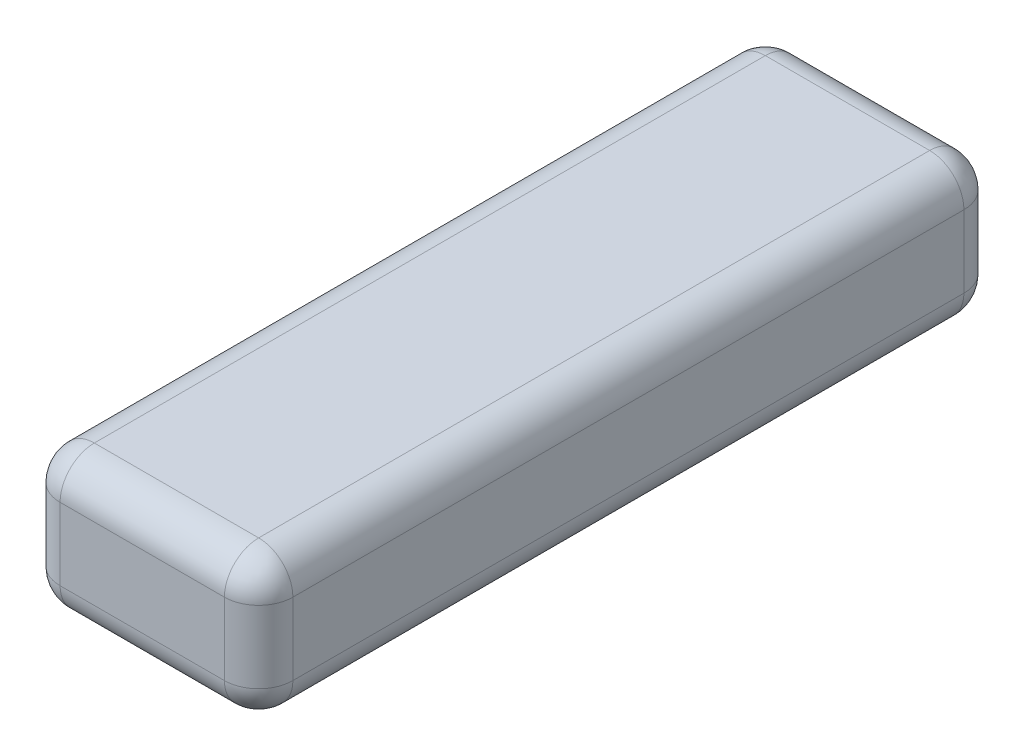
ISO-10303-21;
HEADER;
FILE_DESCRIPTION(('STEP AP214'),'2;1');
FILE_NAME('part.step','',(''),(''),'','','');
FILE_SCHEMA(('AUTOMOTIVE_DESIGN { 1 0 10303 214 1 1 1 1 }'));
ENDSEC;
DATA;
#1=APPLICATION_CONTEXT('core data for automotive mechanical design processes');
#2=APPLICATION_PROTOCOL_DEFINITION('international standard','automotive_design',2000,#1);
#3=PRODUCT_CONTEXT('',#1,'mechanical');
#4=PRODUCT('Part','Part','',(#3));
#5=PRODUCT_RELATED_PRODUCT_CATEGORY('part','',(#4));
#6=PRODUCT_DEFINITION_FORMATION('','',#4);
#7=PRODUCT_DEFINITION_CONTEXT('part definition',#1,'design');
#8=PRODUCT_DEFINITION('design','',#6,#7);
#9=PRODUCT_DEFINITION_SHAPE('','',#8);
#10=(LENGTH_UNIT() NAMED_UNIT(*) SI_UNIT(.MILLI.,.METRE.));
#11=(NAMED_UNIT(*) PLANE_ANGLE_UNIT() SI_UNIT($,.RADIAN.));
#12=(NAMED_UNIT(*) SI_UNIT($,.STERADIAN.) SOLID_ANGLE_UNIT());
#13=UNCERTAINTY_MEASURE_WITH_UNIT(LENGTH_MEASURE(1.E-05),#10,'distance_accuracy_value','');
#14=(GEOMETRIC_REPRESENTATION_CONTEXT(3) GLOBAL_UNCERTAINTY_ASSIGNED_CONTEXT((#13)) GLOBAL_UNIT_ASSIGNED_CONTEXT((#10,
#11,#12)) REPRESENTATION_CONTEXT('',''));
#15=CARTESIAN_POINT('',(0.,0.,0.));
#16=DIRECTION('',(0.,0.,1.));
#17=DIRECTION('',(1.,0.,0.));
#18=AXIS2_PLACEMENT_3D('',#15,#16,#17);
#19=CARTESIAN_POINT('',(17.,-10.05,54.));
#20=DIRECTION('',(1.,0.,0.));
#21=DIRECTION('',(0.,0.,-1.));
#22=AXIS2_PLACEMENT_3D('',#19,#20,#21);
#23=PLANE('',#22);
#24=DIRECTION('',(0.,1.,0.));
#25=VECTOR('',#24,1.);
#26=CARTESIAN_POINT('',(17.,-10.05,49.));
#27=LINE('',#26,#25);
#28=CARTESIAN_POINT('',(17.,5.5,49.));
#29=VERTEX_POINT('',#28);
#30=CARTESIAN_POINT('',(17.,-5.05,49.));
#31=VERTEX_POINT('',#30);
#32=EDGE_CURVE('E157',#29,#31,#27,.F.);
#33=ORIENTED_EDGE('',*,*,#32,.T.);
#34=DIRECTION('',(0.,0.,-1.));
#35=VECTOR('',#34,1.);
#36=CARTESIAN_POINT('',(17.,-5.05,54.));
#37=LINE('',#36,#35);
#38=CARTESIAN_POINT('',(17.,-5.05,-49.));
#39=VERTEX_POINT('',#38);
#40=EDGE_CURVE('E133',#31,#39,#37,.T.);
#41=ORIENTED_EDGE('',*,*,#40,.T.);
#42=DIRECTION('',(0.,1.,0.));
#43=VECTOR('',#42,1.);
#44=CARTESIAN_POINT('',(17.,-10.05,-49.));
#45=LINE('',#44,#43);
#46=CARTESIAN_POINT('',(17.,5.5,-49.));
#47=VERTEX_POINT('',#46);
#48=EDGE_CURVE('E154',#39,#47,#45,.T.);
#49=ORIENTED_EDGE('',*,*,#48,.T.);
#50=DIRECTION('',(0.,0.,-1.));
#51=VECTOR('',#50,1.);
#52=CARTESIAN_POINT('',(17.,5.5,49.));
#53=LINE('',#52,#51);
#54=EDGE_CURVE('E160',#47,#29,#53,.F.);
#55=ORIENTED_EDGE('',*,*,#54,.T.);
#56=EDGE_LOOP('',(#33,#41,#49,#55));
#57=FACE_BOUND('',#56,.T.);
#58=ADVANCED_FACE('F38',(#57),#23,.T.);
#59=CARTESIAN_POINT('',(-17.,-10.05,54.));
#60=DIRECTION('',(0.,0.,1.));
#61=DIRECTION('',(1.,0.,0.));
#62=AXIS2_PLACEMENT_3D('',#59,#60,#61);
#63=PLANE('',#62);
#64=DIRECTION('',(0.,1.,0.));
#65=VECTOR('',#64,1.);
#66=CARTESIAN_POINT('',(-12.,-10.05,54.));
#67=LINE('',#66,#65);
#68=CARTESIAN_POINT('',(-12.,5.5,54.));
#69=VERTEX_POINT('',#68);
#70=CARTESIAN_POINT('',(-12.,-5.05,54.));
#71=VERTEX_POINT('',#70);
#72=EDGE_CURVE('E182',#69,#71,#67,.F.);
#73=ORIENTED_EDGE('',*,*,#72,.T.);
#74=DIRECTION('',(1.,0.,0.));
#75=VECTOR('',#74,1.);
#76=CARTESIAN_POINT('',(-17.,-5.05,54.));
#77=LINE('',#76,#75);
#78=CARTESIAN_POINT('',(12.,-5.05,54.));
#79=VERTEX_POINT('',#78);
#80=EDGE_CURVE('E211',#71,#79,#77,.T.);
#81=ORIENTED_EDGE('',*,*,#80,.T.);
#82=DIRECTION('',(0.,1.,0.));
#83=VECTOR('',#82,1.);
#84=CARTESIAN_POINT('',(12.,-10.05,54.));
#85=LINE('',#84,#83);
#86=CARTESIAN_POINT('',(12.,5.5,54.));
#87=VERTEX_POINT('',#86);
#88=EDGE_CURVE('E179',#79,#87,#85,.T.);
#89=ORIENTED_EDGE('',*,*,#88,.T.);
#90=DIRECTION('',(1.,0.,0.));
#91=VECTOR('',#90,1.);
#92=CARTESIAN_POINT('',(-12.,5.5,54.));
#93=LINE('',#92,#91);
#94=EDGE_CURVE('E208',#87,#69,#93,.F.);
#95=ORIENTED_EDGE('',*,*,#94,.T.);
#96=EDGE_LOOP('',(#73,#81,#89,#95));
#97=FACE_BOUND('',#96,.T.);
#98=ADVANCED_FACE('F300',(#97),#63,.T.);
#99=CARTESIAN_POINT('',(-17.,-10.05,54.));
#100=DIRECTION('',(-1.,0.,0.));
#101=DIRECTION('',(0.,0.,1.));
#102=AXIS2_PLACEMENT_3D('',#99,#100,#101);
#103=PLANE('',#102);
#104=DIRECTION('',(0.,1.,0.));
#105=VECTOR('',#104,1.);
#106=CARTESIAN_POINT('',(-17.,-10.05,-49.));
#107=LINE('',#106,#105);
#108=CARTESIAN_POINT('',(-17.,5.5,-49.));
#109=VERTEX_POINT('',#108);
#110=CARTESIAN_POINT('',(-17.,-5.05,-49.));
#111=VERTEX_POINT('',#110);
#112=EDGE_CURVE('E176',#109,#111,#107,.F.);
#113=ORIENTED_EDGE('',*,*,#112,.T.);
#114=DIRECTION('',(0.,0.,1.));
#115=VECTOR('',#114,1.);
#116=CARTESIAN_POINT('',(-17.,-5.05,54.));
#117=LINE('',#116,#115);
#118=CARTESIAN_POINT('',(-17.,-5.05,49.));
#119=VERTEX_POINT('',#118);
#120=EDGE_CURVE('E202',#111,#119,#117,.T.);
#121=ORIENTED_EDGE('',*,*,#120,.T.);
#122=DIRECTION('',(0.,1.,0.));
#123=VECTOR('',#122,1.);
#124=CARTESIAN_POINT('',(-17.,-10.05,49.));
#125=LINE('',#124,#123);
#126=CARTESIAN_POINT('',(-17.,5.5,49.));
#127=VERTEX_POINT('',#126);
#128=EDGE_CURVE('E173',#119,#127,#125,.T.);
#129=ORIENTED_EDGE('',*,*,#128,.T.);
#130=DIRECTION('',(0.,0.,1.));
#131=VECTOR('',#130,1.);
#132=CARTESIAN_POINT('',(-17.,5.5,-49.));
#133=LINE('',#132,#131);
#134=EDGE_CURVE('E200',#127,#109,#133,.F.);
#135=ORIENTED_EDGE('',*,*,#134,.T.);
#136=EDGE_LOOP('',(#113,#121,#129,#135));
#137=FACE_BOUND('',#136,.T.);
#138=ADVANCED_FACE('F288',(#137),#103,.T.);
#139=CARTESIAN_POINT('',(-17.,-10.05,-54.));
#140=DIRECTION('',(0.,0.,-1.));
#141=DIRECTION('',(-1.,0.,0.));
#142=AXIS2_PLACEMENT_3D('',#139,#140,#141);
#143=PLANE('',#142);
#144=DIRECTION('',(0.,1.,0.));
#145=VECTOR('',#144,1.);
#146=CARTESIAN_POINT('',(12.,-10.05,-54.));
#147=LINE('',#146,#145);
#148=CARTESIAN_POINT('',(12.,5.5,-54.));
#149=VERTEX_POINT('',#148);
#150=CARTESIAN_POINT('',(12.,-5.05,-54.));
#151=VERTEX_POINT('',#150);
#152=EDGE_CURVE('E167',#149,#151,#147,.F.);
#153=ORIENTED_EDGE('',*,*,#152,.T.);
#154=DIRECTION('',(-1.,0.,0.));
#155=VECTOR('',#154,1.);
#156=CARTESIAN_POINT('',(-17.,-5.05,-54.));
#157=LINE('',#156,#155);
#158=CARTESIAN_POINT('',(-12.,-5.05,-54.));
#159=VERTEX_POINT('',#158);
#160=EDGE_CURVE('E194',#151,#159,#157,.T.);
#161=ORIENTED_EDGE('',*,*,#160,.T.);
#162=DIRECTION('',(0.,1.,0.));
#163=VECTOR('',#162,1.);
#164=CARTESIAN_POINT('',(-12.,-10.05,-54.));
#165=LINE('',#164,#163);
#166=CARTESIAN_POINT('',(-12.,5.5,-54.));
#167=VERTEX_POINT('',#166);
#168=EDGE_CURVE('E164',#159,#167,#165,.T.);
#169=ORIENTED_EDGE('',*,*,#168,.T.);
#170=DIRECTION('',(-1.,0.,0.));
#171=VECTOR('',#170,1.);
#172=CARTESIAN_POINT('',(12.,5.5,-54.));
#173=LINE('',#172,#171);
#174=EDGE_CURVE('E148',#167,#149,#173,.F.);
#175=ORIENTED_EDGE('',*,*,#174,.T.);
#176=EDGE_LOOP('',(#153,#161,#169,#175));
#177=FACE_BOUND('',#176,.T.);
#178=ADVANCED_FACE('F263',(#177),#143,.T.);
#179=CARTESIAN_POINT('',(0.,-10.05,0.));
#180=DIRECTION('',(0.,-1.,0.));
#181=DIRECTION('',(0.,0.,-1.));
#182=AXIS2_PLACEMENT_3D('',#179,#180,#181);
#183=PLANE('',#182);
#184=DIRECTION('',(-1.,0.,0.));
#185=VECTOR('',#184,1.);
#186=CARTESIAN_POINT('',(0.,-10.05,-49.));
#187=LINE('',#186,#185);
#188=CARTESIAN_POINT('',(-12.,-10.05,-49.));
#189=VERTEX_POINT('',#188);
#190=CARTESIAN_POINT('',(12.,-10.05,-49.));
#191=VERTEX_POINT('',#190);
#192=EDGE_CURVE('E189',#189,#191,#187,.F.);
#193=ORIENTED_EDGE('',*,*,#192,.T.);
#194=DIRECTION('',(0.,0.,-1.));
#195=VECTOR('',#194,1.);
#196=CARTESIAN_POINT('',(12.,-10.05,0.));
#197=LINE('',#196,#195);
#198=CARTESIAN_POINT('',(12.,-10.05,49.));
#199=VERTEX_POINT('',#198);
#200=EDGE_CURVE('E135',#191,#199,#197,.F.);
#201=ORIENTED_EDGE('',*,*,#200,.T.);
#202=DIRECTION('',(1.,0.,0.));
#203=VECTOR('',#202,1.);
#204=CARTESIAN_POINT('',(0.,-10.05,49.));
#205=LINE('',#204,#203);
#206=CARTESIAN_POINT('',(-12.,-10.05,49.));
#207=VERTEX_POINT('',#206);
#208=EDGE_CURVE('E159',#199,#207,#205,.F.);
#209=ORIENTED_EDGE('',*,*,#208,.T.);
#210=DIRECTION('',(0.,0.,1.));
#211=VECTOR('',#210,1.);
#212=CARTESIAN_POINT('',(-12.,-10.05,0.));
#213=LINE('',#212,#211);
#214=EDGE_CURVE('E187',#207,#189,#213,.F.);
#215=ORIENTED_EDGE('',*,*,#214,.T.);
#216=EDGE_LOOP('',(#193,#201,#209,#215));
#217=FACE_BOUND('',#216,.T.);
#218=ADVANCED_FACE('F278',(#217),#183,.T.);
#219=CARTESIAN_POINT('',(0.,10.5,0.));
#220=DIRECTION('',(0.,-1.,0.));
#221=DIRECTION('',(0.,0.,-1.));
#222=AXIS2_PLACEMENT_3D('',#219,#220,#221);
#223=PLANE('',#222);
#224=DIRECTION('',(0.,0.,1.));
#225=VECTOR('',#224,1.);
#226=CARTESIAN_POINT('',(-12.,10.5,49.));
#227=LINE('',#226,#225);
#228=CARTESIAN_POINT('',(-12.,10.5,-49.));
#229=VERTEX_POINT('',#228);
#230=CARTESIAN_POINT('',(-12.,10.5,49.));
#231=VERTEX_POINT('',#230);
#232=EDGE_CURVE('E55',#229,#231,#227,.T.);
#233=ORIENTED_EDGE('',*,*,#232,.T.);
#234=DIRECTION('',(1.,0.,0.));
#235=VECTOR('',#234,1.);
#236=CARTESIAN_POINT('',(12.,10.5,49.));
#237=LINE('',#236,#235);
#238=CARTESIAN_POINT('',(12.,10.5,49.));
#239=VERTEX_POINT('',#238);
#240=EDGE_CURVE('E217',#231,#239,#237,.T.);
#241=ORIENTED_EDGE('',*,*,#240,.T.);
#242=DIRECTION('',(0.,0.,-1.));
#243=VECTOR('',#242,1.);
#244=CARTESIAN_POINT('',(12.,10.5,-49.));
#245=LINE('',#244,#243);
#246=CARTESIAN_POINT('',(12.,10.5,-49.));
#247=VERTEX_POINT('',#246);
#248=EDGE_CURVE('E213',#239,#247,#245,.T.);
#249=ORIENTED_EDGE('',*,*,#248,.T.);
#250=DIRECTION('',(-1.,0.,0.));
#251=VECTOR('',#250,1.);
#252=CARTESIAN_POINT('',(-12.,10.5,-49.));
#253=LINE('',#252,#251);
#254=EDGE_CURVE('E60',#247,#229,#253,.T.);
#255=ORIENTED_EDGE('',*,*,#254,.T.);
#256=EDGE_LOOP('',(#233,#241,#249,#255));
#257=FACE_BOUND('',#256,.T.);
#258=ADVANCED_FACE('F314',(#257),#223,.F.);
#259=CARTESIAN_POINT('',(12.,-10.05,-49.));
#260=DIRECTION('',(0.,1.,0.));
#261=DIRECTION('',(0.,0.,1.));
#262=AXIS2_PLACEMENT_3D('',#259,#260,#261);
#263=CYLINDRICAL_SURFACE('',#262,5.);
#264=ORIENTED_EDGE('',*,*,#48,.F.);
#265=CARTESIAN_POINT('',(12.,-5.05,-49.));
#266=DIRECTION('',(0.,1.,0.));
#267=DIRECTION('',(0.,0.,1.));
#268=AXIS2_PLACEMENT_3D('',#265,#266,#267);
#269=CIRCLE('',#268,5.);
#270=EDGE_CURVE('E140',#39,#151,#269,.T.);
#271=ORIENTED_EDGE('',*,*,#270,.T.);
#272=ORIENTED_EDGE('',*,*,#152,.F.);
#273=CARTESIAN_POINT('',(12.,5.5,-49.));
#274=DIRECTION('',(0.,1.,0.));
#275=DIRECTION('',(0.,0.,1.));
#276=AXIS2_PLACEMENT_3D('',#273,#274,#275);
#277=CIRCLE('',#276,5.);
#278=EDGE_CURVE('E149',#149,#47,#277,.F.);
#279=ORIENTED_EDGE('',*,*,#278,.T.);
#280=EDGE_LOOP('',(#264,#271,#272,#279));
#281=FACE_BOUND('',#280,.T.);
#282=ADVANCED_FACE('F162',(#281),#263,.T.);
#283=CARTESIAN_POINT('',(-12.,-10.05,-49.));
#284=DIRECTION('',(0.,1.,0.));
#285=DIRECTION('',(0.,0.,1.));
#286=AXIS2_PLACEMENT_3D('',#283,#284,#285);
#287=CYLINDRICAL_SURFACE('',#286,5.);
#288=ORIENTED_EDGE('',*,*,#168,.F.);
#289=CARTESIAN_POINT('',(-12.,-5.05,-49.));
#290=DIRECTION('',(0.,1.,0.));
#291=DIRECTION('',(0.,0.,1.));
#292=AXIS2_PLACEMENT_3D('',#289,#290,#291);
#293=CIRCLE('',#292,5.);
#294=EDGE_CURVE('E198',#159,#111,#293,.T.);
#295=ORIENTED_EDGE('',*,*,#294,.T.);
#296=ORIENTED_EDGE('',*,*,#112,.F.);
#297=CARTESIAN_POINT('',(-12.,5.5,-49.));
#298=DIRECTION('',(0.,1.,0.));
#299=DIRECTION('',(0.,0.,1.));
#300=AXIS2_PLACEMENT_3D('',#297,#298,#299);
#301=CIRCLE('',#300,5.);
#302=EDGE_CURVE('E196',#109,#167,#301,.F.);
#303=ORIENTED_EDGE('',*,*,#302,.T.);
#304=EDGE_LOOP('',(#288,#295,#296,#303));
#305=FACE_BOUND('',#304,.T.);
#306=ADVANCED_FACE('F268',(#305),#287,.T.);
#307=CARTESIAN_POINT('',(-12.,-10.05,49.));
#308=DIRECTION('',(0.,1.,0.));
#309=DIRECTION('',(0.,0.,1.));
#310=AXIS2_PLACEMENT_3D('',#307,#308,#309);
#311=CYLINDRICAL_SURFACE('',#310,5.);
#312=ORIENTED_EDGE('',*,*,#128,.F.);
#313=CARTESIAN_POINT('',(-12.,-5.05,49.));
#314=DIRECTION('',(0.,1.,0.));
#315=DIRECTION('',(0.,0.,1.));
#316=AXIS2_PLACEMENT_3D('',#313,#314,#315);
#317=CIRCLE('',#316,5.);
#318=EDGE_CURVE('E206',#119,#71,#317,.T.);
#319=ORIENTED_EDGE('',*,*,#318,.T.);
#320=ORIENTED_EDGE('',*,*,#72,.F.);
#321=CARTESIAN_POINT('',(-12.,5.5,49.));
#322=DIRECTION('',(0.,1.,0.));
#323=DIRECTION('',(0.,0.,1.));
#324=AXIS2_PLACEMENT_3D('',#321,#322,#323);
#325=CIRCLE('',#324,5.);
#326=EDGE_CURVE('E204',#69,#127,#325,.F.);
#327=ORIENTED_EDGE('',*,*,#326,.T.);
#328=EDGE_LOOP('',(#312,#319,#320,#327));
#329=FACE_BOUND('',#328,.T.);
#330=ADVANCED_FACE('F291',(#329),#311,.T.);
#331=CARTESIAN_POINT('',(12.,-10.05,49.));
#332=DIRECTION('',(0.,1.,0.));
#333=DIRECTION('',(0.,0.,1.));
#334=AXIS2_PLACEMENT_3D('',#331,#332,#333);
#335=CYLINDRICAL_SURFACE('',#334,5.);
#336=ORIENTED_EDGE('',*,*,#88,.F.);
#337=CARTESIAN_POINT('',(12.,-5.05,49.));
#338=DIRECTION('',(0.,1.,0.));
#339=DIRECTION('',(0.,0.,1.));
#340=AXIS2_PLACEMENT_3D('',#337,#338,#339);
#341=CIRCLE('',#340,5.);
#342=EDGE_CURVE('E11',#79,#31,#341,.T.);
#343=ORIENTED_EDGE('',*,*,#342,.T.);
#344=ORIENTED_EDGE('',*,*,#32,.F.);
#345=CARTESIAN_POINT('',(12.,5.5,49.));
#346=DIRECTION('',(0.,1.,0.));
#347=DIRECTION('',(0.,0.,1.));
#348=AXIS2_PLACEMENT_3D('',#345,#346,#347);
#349=CIRCLE('',#348,5.);
#350=EDGE_CURVE('E47',#29,#87,#349,.F.);
#351=ORIENTED_EDGE('',*,*,#350,.T.);
#352=EDGE_LOOP('',(#336,#343,#344,#351));
#353=FACE_BOUND('',#352,.T.);
#354=ADVANCED_FACE('F336',(#353),#335,.T.);
#355=CARTESIAN_POINT('',(-12.,-5.05,54.));
#356=DIRECTION('',(0.,0.,1.));
#357=DIRECTION('',(1.,0.,0.));
#358=AXIS2_PLACEMENT_3D('',#355,#356,#357);
#359=CYLINDRICAL_SURFACE('',#358,5.);
#360=CARTESIAN_POINT('',(-12.,-5.05,49.));
#361=DIRECTION('',(0.,0.,1.));
#362=DIRECTION('',(1.,0.,0.));
#363=AXIS2_PLACEMENT_3D('',#360,#361,#362);
#364=CIRCLE('',#363,5.);
#365=EDGE_CURVE('E169',#119,#207,#364,.T.);
#366=ORIENTED_EDGE('',*,*,#365,.F.);
#367=ORIENTED_EDGE('',*,*,#120,.F.);
#368=CARTESIAN_POINT('',(-12.,-5.05,-49.));
#369=DIRECTION('',(0.,0.,-1.));
#370=DIRECTION('',(-1.,0.,0.));
#371=AXIS2_PLACEMENT_3D('',#368,#369,#370);
#372=CIRCLE('',#371,5.);
#373=EDGE_CURVE('E231',#189,#111,#372,.T.);
#374=ORIENTED_EDGE('',*,*,#373,.F.);
#375=ORIENTED_EDGE('',*,*,#214,.F.);
#376=EDGE_LOOP('',(#366,#367,#374,#375));
#377=FACE_BOUND('',#376,.T.);
#378=ADVANCED_FACE('F284',(#377),#359,.T.);
#379=CARTESIAN_POINT('',(-12.,-5.05,49.));
#380=DIRECTION('',(0.,-1.,0.));
#381=DIRECTION('',(0.,0.,-1.));
#382=AXIS2_PLACEMENT_3D('',#379,#380,#381);
#383=SPHERICAL_SURFACE('',#382,5.);
#384=ORIENTED_EDGE('',*,*,#318,.F.);
#385=ORIENTED_EDGE('',*,*,#365,.T.);
#386=CARTESIAN_POINT('',(-12.,-5.05,49.));
#387=DIRECTION('',(1.,0.,0.));
#388=DIRECTION('',(0.,0.,-1.));
#389=AXIS2_PLACEMENT_3D('',#386,#387,#388);
#390=CIRCLE('',#389,5.);
#391=EDGE_CURVE('E228',#71,#207,#390,.T.);
#392=ORIENTED_EDGE('',*,*,#391,.F.);
#393=EDGE_LOOP('',(#384,#385,#392));
#394=FACE_BOUND('',#393,.T.);
#395=ADVANCED_FACE('F356',(#394),#383,.T.);
#396=CARTESIAN_POINT('',(-12.,-5.05,-49.));
#397=DIRECTION('',(0.,-1.,0.));
#398=DIRECTION('',(0.,0.,-1.));
#399=AXIS2_PLACEMENT_3D('',#396,#397,#398);
#400=SPHERICAL_SURFACE('',#399,5.);
#401=ORIENTED_EDGE('',*,*,#373,.T.);
#402=ORIENTED_EDGE('',*,*,#294,.F.);
#403=CARTESIAN_POINT('',(-12.,-5.05,-49.));
#404=DIRECTION('',(1.,0.,0.));
#405=DIRECTION('',(0.,0.,-1.));
#406=AXIS2_PLACEMENT_3D('',#403,#404,#405);
#407=CIRCLE('',#406,5.);
#408=EDGE_CURVE('E225',#189,#159,#407,.T.);
#409=ORIENTED_EDGE('',*,*,#408,.F.);
#410=EDGE_LOOP('',(#401,#402,#409));
#411=FACE_BOUND('',#410,.T.);
#412=ADVANCED_FACE('F272',(#411),#400,.T.);
#413=CARTESIAN_POINT('',(-17.,-5.05,49.));
#414=DIRECTION('',(1.,0.,0.));
#415=DIRECTION('',(0.,0.,-1.));
#416=AXIS2_PLACEMENT_3D('',#413,#414,#415);
#417=CYLINDRICAL_SURFACE('',#416,5.);
#418=ORIENTED_EDGE('',*,*,#391,.T.);
#419=ORIENTED_EDGE('',*,*,#208,.F.);
#420=CARTESIAN_POINT('',(12.,-5.05,49.));
#421=DIRECTION('',(1.,0.,0.));
#422=DIRECTION('',(0.,0.,-1.));
#423=AXIS2_PLACEMENT_3D('',#420,#421,#422);
#424=CIRCLE('',#423,5.);
#425=EDGE_CURVE('E222',#79,#199,#424,.T.);
#426=ORIENTED_EDGE('',*,*,#425,.F.);
#427=ORIENTED_EDGE('',*,*,#80,.F.);
#428=EDGE_LOOP('',(#418,#419,#426,#427));
#429=FACE_BOUND('',#428,.T.);
#430=ADVANCED_FACE('F350',(#429),#417,.T.);
#431=CARTESIAN_POINT('',(-17.,-5.05,-49.));
#432=DIRECTION('',(-1.,0.,0.));
#433=DIRECTION('',(0.,0.,1.));
#434=AXIS2_PLACEMENT_3D('',#431,#432,#433);
#435=CYLINDRICAL_SURFACE('',#434,5.);
#436=ORIENTED_EDGE('',*,*,#408,.T.);
#437=ORIENTED_EDGE('',*,*,#160,.F.);
#438=CARTESIAN_POINT('',(12.,-5.05,-49.));
#439=DIRECTION('',(1.,0.,0.));
#440=DIRECTION('',(0.,0.,-1.));
#441=AXIS2_PLACEMENT_3D('',#438,#439,#440);
#442=CIRCLE('',#441,5.);
#443=EDGE_CURVE('E143',#191,#151,#442,.T.);
#444=ORIENTED_EDGE('',*,*,#443,.F.);
#445=ORIENTED_EDGE('',*,*,#192,.F.);
#446=EDGE_LOOP('',(#436,#437,#444,#445));
#447=FACE_BOUND('',#446,.T.);
#448=ADVANCED_FACE('F276',(#447),#435,.T.);
#449=CARTESIAN_POINT('',(12.,-5.05,49.));
#450=DIRECTION('',(0.,-1.,0.));
#451=DIRECTION('',(0.,0.,-1.));
#452=AXIS2_PLACEMENT_3D('',#449,#450,#451);
#453=SPHERICAL_SURFACE('',#452,5.);
#454=ORIENTED_EDGE('',*,*,#342,.F.);
#455=ORIENTED_EDGE('',*,*,#425,.T.);
#456=CARTESIAN_POINT('',(12.,-5.05,49.));
#457=DIRECTION('',(0.,0.,-1.));
#458=DIRECTION('',(-1.,0.,0.));
#459=AXIS2_PLACEMENT_3D('',#456,#457,#458);
#460=CIRCLE('',#459,5.);
#461=EDGE_CURVE('E138',#31,#199,#460,.T.);
#462=ORIENTED_EDGE('',*,*,#461,.F.);
#463=EDGE_LOOP('',(#454,#455,#462));
#464=FACE_BOUND('',#463,.T.);
#465=ADVANCED_FACE('F344',(#464),#453,.T.);
#466=CARTESIAN_POINT('',(12.,-5.05,-49.));
#467=DIRECTION('',(0.,-1.,0.));
#468=DIRECTION('',(0.,0.,-1.));
#469=AXIS2_PLACEMENT_3D('',#466,#467,#468);
#470=SPHERICAL_SURFACE('',#469,5.);
#471=ORIENTED_EDGE('',*,*,#443,.T.);
#472=ORIENTED_EDGE('',*,*,#270,.F.);
#473=CARTESIAN_POINT('',(12.,-5.05,-49.));
#474=DIRECTION('',(0.,0.,1.));
#475=DIRECTION('',(1.,0.,0.));
#476=AXIS2_PLACEMENT_3D('',#473,#474,#475);
#477=CIRCLE('',#476,5.);
#478=EDGE_CURVE('E129',#191,#39,#477,.T.);
#479=ORIENTED_EDGE('',*,*,#478,.F.);
#480=EDGE_LOOP('',(#471,#472,#479));
#481=FACE_BOUND('',#480,.T.);
#482=ADVANCED_FACE('F141',(#481),#470,.T.);
#483=CARTESIAN_POINT('',(12.,-5.05,54.));
#484=DIRECTION('',(0.,0.,-1.));
#485=DIRECTION('',(-1.,0.,0.));
#486=AXIS2_PLACEMENT_3D('',#483,#484,#485);
#487=CYLINDRICAL_SURFACE('',#486,5.);
#488=ORIENTED_EDGE('',*,*,#461,.T.);
#489=ORIENTED_EDGE('',*,*,#200,.F.);
#490=ORIENTED_EDGE('',*,*,#478,.T.);
#491=ORIENTED_EDGE('',*,*,#40,.F.);
#492=EDGE_LOOP('',(#488,#489,#490,#491));
#493=FACE_BOUND('',#492,.T.);
#494=ADVANCED_FACE('F131',(#493),#487,.T.);
#495=CARTESIAN_POINT('',(0.,5.5,-49.));
#496=DIRECTION('',(1.,0.,0.));
#497=DIRECTION('',(0.,0.,-1.));
#498=AXIS2_PLACEMENT_3D('',#495,#496,#497);
#499=CYLINDRICAL_SURFACE('',#498,5.);
#500=CARTESIAN_POINT('',(12.,5.5,-49.));
#501=DIRECTION('',(1.,0.,0.));
#502=DIRECTION('',(0.,0.,-1.));
#503=AXIS2_PLACEMENT_3D('',#500,#501,#502);
#504=CIRCLE('',#503,5.);
#505=EDGE_CURVE('E251',#149,#247,#504,.T.);
#506=ORIENTED_EDGE('',*,*,#505,.F.);
#507=ORIENTED_EDGE('',*,*,#174,.F.);
#508=CARTESIAN_POINT('',(-12.,5.5,-49.));
#509=DIRECTION('',(-1.,0.,0.));
#510=DIRECTION('',(0.,0.,1.));
#511=AXIS2_PLACEMENT_3D('',#508,#509,#510);
#512=CIRCLE('',#511,5.);
#513=EDGE_CURVE('E42',#229,#167,#512,.T.);
#514=ORIENTED_EDGE('',*,*,#513,.F.);
#515=ORIENTED_EDGE('',*,*,#254,.F.);
#516=EDGE_LOOP('',(#506,#507,#514,#515));
#517=FACE_BOUND('',#516,.T.);
#518=ADVANCED_FACE('F40',(#517),#499,.T.);
#519=CARTESIAN_POINT('',(-12.,5.5,-49.));
#520=DIRECTION('',(0.,-1.,0.));
#521=DIRECTION('',(0.,0.,-1.));
#522=AXIS2_PLACEMENT_3D('',#519,#520,#521);
#523=SPHERICAL_SURFACE('',#522,5.);
#524=ORIENTED_EDGE('',*,*,#513,.T.);
#525=ORIENTED_EDGE('',*,*,#302,.F.);
#526=CARTESIAN_POINT('',(-12.,5.5,-49.));
#527=DIRECTION('',(0.,0.,1.));
#528=DIRECTION('',(1.,0.,0.));
#529=AXIS2_PLACEMENT_3D('',#526,#527,#528);
#530=CIRCLE('',#529,5.);
#531=EDGE_CURVE('E249',#229,#109,#530,.T.);
#532=ORIENTED_EDGE('',*,*,#531,.F.);
#533=EDGE_LOOP('',(#524,#525,#532));
#534=FACE_BOUND('',#533,.T.);
#535=ADVANCED_FACE('F259',(#534),#523,.T.);
#536=CARTESIAN_POINT('',(12.,5.5,-49.));
#537=DIRECTION('',(0.,-1.,0.));
#538=DIRECTION('',(0.,0.,-1.));
#539=AXIS2_PLACEMENT_3D('',#536,#537,#538);
#540=SPHERICAL_SURFACE('',#539,5.);
#541=ORIENTED_EDGE('',*,*,#278,.F.);
#542=ORIENTED_EDGE('',*,*,#505,.T.);
#543=CARTESIAN_POINT('',(12.,5.5,-49.));
#544=DIRECTION('',(0.,0.,1.));
#545=DIRECTION('',(1.,0.,0.));
#546=AXIS2_PLACEMENT_3D('',#543,#544,#545);
#547=CIRCLE('',#546,5.);
#548=EDGE_CURVE('E246',#47,#247,#547,.T.);
#549=ORIENTED_EDGE('',*,*,#548,.F.);
#550=EDGE_LOOP('',(#541,#542,#549));
#551=FACE_BOUND('',#550,.T.);
#552=ADVANCED_FACE('F373',(#551),#540,.T.);
#553=CARTESIAN_POINT('',(-12.,5.5,0.));
#554=DIRECTION('',(0.,0.,-1.));
#555=DIRECTION('',(-1.,0.,0.));
#556=AXIS2_PLACEMENT_3D('',#553,#554,#555);
#557=CYLINDRICAL_SURFACE('',#556,5.);
#558=ORIENTED_EDGE('',*,*,#531,.T.);
#559=ORIENTED_EDGE('',*,*,#134,.F.);
#560=CARTESIAN_POINT('',(-12.,5.5,49.));
#561=DIRECTION('',(0.,0.,1.));
#562=DIRECTION('',(1.,0.,0.));
#563=AXIS2_PLACEMENT_3D('',#560,#561,#562);
#564=CIRCLE('',#563,5.);
#565=EDGE_CURVE('E243',#231,#127,#564,.T.);
#566=ORIENTED_EDGE('',*,*,#565,.F.);
#567=ORIENTED_EDGE('',*,*,#232,.F.);
#568=EDGE_LOOP('',(#558,#559,#566,#567));
#569=FACE_BOUND('',#568,.T.);
#570=ADVANCED_FACE('F370',(#569),#557,.T.);
#571=CARTESIAN_POINT('',(12.,5.5,0.));
#572=DIRECTION('',(0.,0.,1.));
#573=DIRECTION('',(1.,0.,0.));
#574=AXIS2_PLACEMENT_3D('',#571,#572,#573);
#575=CYLINDRICAL_SURFACE('',#574,5.);
#576=ORIENTED_EDGE('',*,*,#548,.T.);
#577=ORIENTED_EDGE('',*,*,#248,.F.);
#578=CARTESIAN_POINT('',(12.,5.5,49.));
#579=DIRECTION('',(0.,0.,1.));
#580=DIRECTION('',(1.,0.,0.));
#581=AXIS2_PLACEMENT_3D('',#578,#579,#580);
#582=CIRCLE('',#581,5.);
#583=EDGE_CURVE('E240',#29,#239,#582,.T.);
#584=ORIENTED_EDGE('',*,*,#583,.F.);
#585=ORIENTED_EDGE('',*,*,#54,.F.);
#586=EDGE_LOOP('',(#576,#577,#584,#585));
#587=FACE_BOUND('',#586,.T.);
#588=ADVANCED_FACE('F313',(#587),#575,.T.);
#589=CARTESIAN_POINT('',(-12.,5.5,49.));
#590=DIRECTION('',(0.,-1.,0.));
#591=DIRECTION('',(0.,0.,-1.));
#592=AXIS2_PLACEMENT_3D('',#589,#590,#591);
#593=SPHERICAL_SURFACE('',#592,5.);
#594=ORIENTED_EDGE('',*,*,#565,.T.);
#595=ORIENTED_EDGE('',*,*,#326,.F.);
#596=CARTESIAN_POINT('',(-12.,5.5,49.));
#597=DIRECTION('',(1.,0.,0.));
#598=DIRECTION('',(0.,0.,-1.));
#599=AXIS2_PLACEMENT_3D('',#596,#597,#598);
#600=CIRCLE('',#599,5.);
#601=EDGE_CURVE('E238',#231,#69,#600,.T.);
#602=ORIENTED_EDGE('',*,*,#601,.F.);
#603=EDGE_LOOP('',(#594,#595,#602));
#604=FACE_BOUND('',#603,.T.);
#605=ADVANCED_FACE('F296',(#604),#593,.T.);
#606=CARTESIAN_POINT('',(12.,5.5,49.));
#607=DIRECTION('',(0.,-1.,0.));
#608=DIRECTION('',(0.,0.,-1.));
#609=AXIS2_PLACEMENT_3D('',#606,#607,#608);
#610=SPHERICAL_SURFACE('',#609,5.);
#611=ORIENTED_EDGE('',*,*,#350,.F.);
#612=ORIENTED_EDGE('',*,*,#583,.T.);
#613=CARTESIAN_POINT('',(12.,5.5,49.));
#614=DIRECTION('',(-1.,0.,0.));
#615=DIRECTION('',(0.,0.,1.));
#616=AXIS2_PLACEMENT_3D('',#613,#614,#615);
#617=CIRCLE('',#616,5.);
#618=EDGE_CURVE('E236',#87,#239,#617,.T.);
#619=ORIENTED_EDGE('',*,*,#618,.F.);
#620=EDGE_LOOP('',(#611,#612,#619));
#621=FACE_BOUND('',#620,.T.);
#622=ADVANCED_FACE('F308',(#621),#610,.T.);
#623=CARTESIAN_POINT('',(0.,5.5,49.));
#624=DIRECTION('',(-1.,0.,0.));
#625=DIRECTION('',(0.,0.,1.));
#626=AXIS2_PLACEMENT_3D('',#623,#624,#625);
#627=CYLINDRICAL_SURFACE('',#626,5.);
#628=ORIENTED_EDGE('',*,*,#601,.T.);
#629=ORIENTED_EDGE('',*,*,#94,.F.);
#630=ORIENTED_EDGE('',*,*,#618,.T.);
#631=ORIENTED_EDGE('',*,*,#240,.F.);
#632=EDGE_LOOP('',(#628,#629,#630,#631));
#633=FACE_BOUND('',#632,.T.);
#634=ADVANCED_FACE('F305',(#633),#627,.T.);
#635=CLOSED_SHELL('',(#58,#98,#138,#178,#218,#258,#282,#306,#330,#354,#378,#395,#412,#430,#448,
#465,#482,#494,#518,#535,#552,#570,#588,#605,#622,#634));
#636=MANIFOLD_SOLID_BREP('B2',#635);
#637=ADVANCED_BREP_SHAPE_REPRESENTATION('',(#18,#636),#14);
#638=SHAPE_DEFINITION_REPRESENTATION(#9,#637);
ENDSEC;
END-ISO-10303-21;
